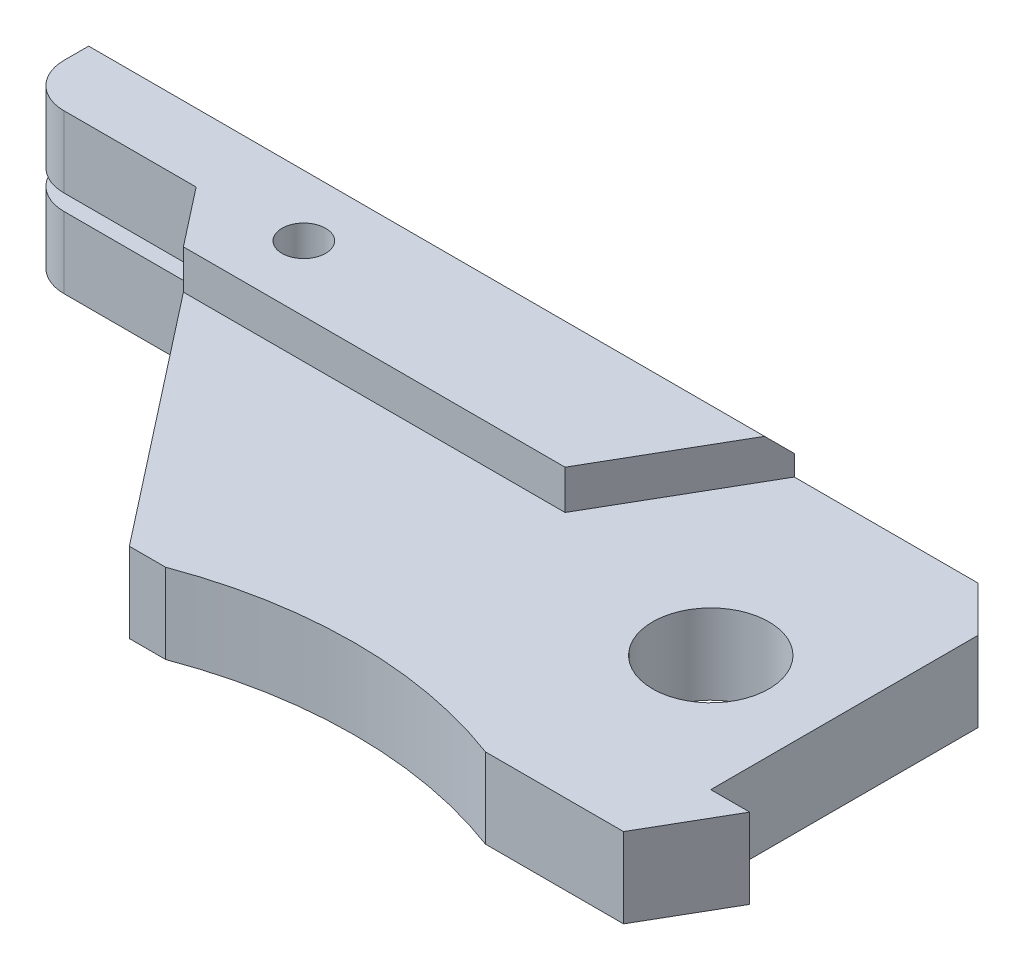
ISO-10303-21;
HEADER;
FILE_DESCRIPTION(('STEP AP214'),'2;1');
FILE_NAME('part.step','',(''),(''),'','','');
FILE_SCHEMA(('AUTOMOTIVE_DESIGN { 1 0 10303 214 1 1 1 1 }'));
ENDSEC;
DATA;
#1=APPLICATION_CONTEXT('core data for automotive mechanical design processes');
#2=APPLICATION_PROTOCOL_DEFINITION('international standard','automotive_design',2000,#1);
#3=PRODUCT_CONTEXT('',#1,'mechanical');
#4=PRODUCT('Part','Part','',(#3));
#5=PRODUCT_RELATED_PRODUCT_CATEGORY('part','',(#4));
#6=PRODUCT_DEFINITION_FORMATION('','',#4);
#7=PRODUCT_DEFINITION_CONTEXT('part definition',#1,'design');
#8=PRODUCT_DEFINITION('design','',#6,#7);
#9=PRODUCT_DEFINITION_SHAPE('','',#8);
#10=(LENGTH_UNIT() NAMED_UNIT(*) SI_UNIT(.MILLI.,.METRE.));
#11=(NAMED_UNIT(*) PLANE_ANGLE_UNIT() SI_UNIT($,.RADIAN.));
#12=(NAMED_UNIT(*) SI_UNIT($,.STERADIAN.) SOLID_ANGLE_UNIT());
#13=UNCERTAINTY_MEASURE_WITH_UNIT(LENGTH_MEASURE(1.E-05),#10,'distance_accuracy_value','');
#14=(GEOMETRIC_REPRESENTATION_CONTEXT(3) GLOBAL_UNCERTAINTY_ASSIGNED_CONTEXT((#13)) GLOBAL_UNIT_ASSIGNED_CONTEXT((#10,
#11,#12)) REPRESENTATION_CONTEXT('',''));
#15=CARTESIAN_POINT('',(0.,0.,0.));
#16=DIRECTION('',(0.,0.,1.));
#17=DIRECTION('',(1.,0.,0.));
#18=AXIS2_PLACEMENT_3D('',#15,#16,#17);
#19=CARTESIAN_POINT('',(-13.,-2.75,42.75));
#20=DIRECTION('',(0.,-1.,0.));
#21=DIRECTION('',(0.,0.,1.));
#22=AXIS2_PLACEMENT_3D('',#19,#20,#21);
#23=PLANE('',#22);
#24=CARTESIAN_POINT('',(0.,-2.75,0.));
#25=DIRECTION('',(0.,1.,0.));
#26=DIRECTION('',(0.,0.,1.));
#27=AXIS2_PLACEMENT_3D('',#24,#25,#26);
#28=CIRCLE('',#27,4.);
#29=CARTESIAN_POINT('',(0.,-2.75,4.));
#30=VERTEX_POINT('',#29);
#31=EDGE_CURVE('E259',#30,#30,#28,.T.);
#32=ORIENTED_EDGE('',*,*,#31,.T.);
#33=EDGE_LOOP('',(#32));
#34=FACE_BOUND('',#33,.T.);
#35=DIRECTION('',(1.,0.,0.));
#36=VECTOR('',#35,1.);
#37=CARTESIAN_POINT('',(-39.7818556506143,-2.75,-3.49999999999999));
#38=LINE('',#37,#36);
#39=CARTESIAN_POINT('',(-39.7818556506143,-2.75,-3.49999999999999));
#40=VERTEX_POINT('',#39);
#41=CARTESIAN_POINT('',(-32.2181443493857,-2.75,-3.49999999999999));
#42=VERTEX_POINT('',#41);
#43=EDGE_CURVE('E277',#40,#42,#38,.T.);
#44=ORIENTED_EDGE('',*,*,#43,.T.);
#45=DIRECTION('',(-0.615661475325657,0.,0.788010753606723));
#46=VECTOR('',#45,1.);
#47=CARTESIAN_POINT('',(-32.2181443493857,-2.75,-3.49999999999999));
#48=LINE('',#47,#46);
#49=CARTESIAN_POINT('',(-28.3117162168521,-2.75,-8.5));
#50=VERTEX_POINT('',#49);
#51=EDGE_CURVE('E225',#50,#42,#48,.T.);
#52=ORIENTED_EDGE('',*,*,#51,.F.);
#53=DIRECTION('',(-1.,0.,0.));
#54=VECTOR('',#53,1.);
#55=CARTESIAN_POINT('',(-28.3117162168521,-2.75,-8.5));
#56=LINE('',#55,#54);
#57=CARTESIAN_POINT('',(-10.6367513459482,-2.75,-8.5));
#58=VERTEX_POINT('',#57);
#59=EDGE_CURVE('E875',#58,#50,#56,.T.);
#60=ORIENTED_EDGE('',*,*,#59,.F.);
#61=DIRECTION('',(0.500000000000004,0.,-0.866025403784436));
#62=VECTOR('',#61,1.);
#63=CARTESIAN_POINT('',(-13.5235026918963,-2.75,-3.5));
#64=LINE('',#63,#62);
#65=CARTESIAN_POINT('',(-7.75,-2.75,-13.5));
#66=VERTEX_POINT('',#65);
#67=EDGE_CURVE('E36',#58,#66,#64,.T.);
#68=ORIENTED_EDGE('',*,*,#67,.T.);
#69=DIRECTION('',(-1.,0.,0.));
#70=VECTOR('',#69,1.);
#71=CARTESIAN_POINT('',(4.88477631085025,-2.75,-13.5));
#72=LINE('',#71,#70);
#73=CARTESIAN_POINT('',(4.88477631085025,-2.75,-13.5));
#74=VERTEX_POINT('',#73);
#75=EDGE_CURVE('E273',#74,#66,#72,.T.);
#76=ORIENTED_EDGE('',*,*,#75,.F.);
#77=DIRECTION('',(-0.707106781186546,0.,-0.707106781186549));
#78=VECTOR('',#77,1.);
#79=CARTESIAN_POINT('',(8.,-2.75,-10.3847763108502));
#80=LINE('',#79,#78);
#81=CARTESIAN_POINT('',(8.,-2.75,-10.3847763108502));
#82=VERTEX_POINT('',#81);
#83=EDGE_CURVE('E276',#82,#74,#80,.T.);
#84=ORIENTED_EDGE('',*,*,#83,.F.);
#85=DIRECTION('',(0.,0.,-1.));
#86=VECTOR('',#85,1.);
#87=CARTESIAN_POINT('',(8.,-2.75,-10.3847763108502));
#88=LINE('',#87,#86);
#89=CARTESIAN_POINT('',(8.,-2.75,8.));
#90=VERTEX_POINT('',#89);
#91=EDGE_CURVE('E283',#90,#82,#88,.T.);
#92=ORIENTED_EDGE('',*,*,#91,.F.);
#93=DIRECTION('',(-1.,0.,0.));
#94=VECTOR('',#93,1.);
#95=CARTESIAN_POINT('',(8.,-2.75,8.));
#96=LINE('',#95,#94);
#97=CARTESIAN_POINT('',(10.6754264805429,-2.75,8.));
#98=VERTEX_POINT('',#97);
#99=EDGE_CURVE('E286',#98,#90,#96,.T.);
#100=ORIENTED_EDGE('',*,*,#99,.F.);
#101=DIRECTION('',(0.499999999999998,0.,-0.86602540378444));
#102=VECTOR('',#101,1.);
#103=CARTESIAN_POINT('',(10.6754264805429,-2.75,8.));
#104=LINE('',#103,#102);
#105=CARTESIAN_POINT('',(7.5,-2.75,13.5));
#106=VERTEX_POINT('',#105);
#107=EDGE_CURVE('E289',#106,#98,#104,.T.);
#108=ORIENTED_EDGE('',*,*,#107,.F.);
#109=DIRECTION('',(1.,0.,0.));
#110=VECTOR('',#109,1.);
#111=CARTESIAN_POINT('',(7.5,-2.75,13.5));
#112=LINE('',#111,#110);
#113=CARTESIAN_POINT('',(-2.,-2.75,13.5));
#114=VERTEX_POINT('',#113);
#115=EDGE_CURVE('E292',#114,#106,#112,.T.);
#116=ORIENTED_EDGE('',*,*,#115,.F.);
#117=CARTESIAN_POINT('',(-13.,-2.75,42.75));
#118=DIRECTION('',(0.,-1.,0.));
#119=DIRECTION('',(0.,0.,1.));
#120=AXIS2_PLACEMENT_3D('',#117,#118,#119);
#121=CIRCLE('',#120,31.25);
#122=CARTESIAN_POINT('',(-24.,-2.75,13.5));
#123=VERTEX_POINT('',#122);
#124=EDGE_CURVE('E294',#123,#114,#121,.T.);
#125=ORIENTED_EDGE('',*,*,#124,.F.);
#126=DIRECTION('',(1.,0.,0.));
#127=VECTOR('',#126,1.);
#128=CARTESIAN_POINT('',(-24.,-2.75,13.5));
#129=LINE('',#128,#127);
#130=CARTESIAN_POINT('',(-26.5,-2.75,13.5));
#131=VERTEX_POINT('',#130);
#132=EDGE_CURVE('E265',#131,#123,#129,.T.);
#133=ORIENTED_EDGE('',*,*,#132,.F.);
#134=DIRECTION('',(0.615661475325663,0.,0.788010753606719));
#135=VECTOR('',#134,1.);
#136=CARTESIAN_POINT('',(-42.9069981566412,-2.75,-7.49999999999999));
#137=LINE('',#136,#135);
#138=EDGE_CURVE('E262',#40,#131,#137,.T.);
#139=ORIENTED_EDGE('',*,*,#138,.F.);
#140=EDGE_LOOP('',(#44,#52,#60,#68,#76,#84,#92,#100,#108,#116,#125,#133,#139));
#141=FACE_BOUND('',#140,.T.);
#142=CARTESIAN_POINT('',(-9.99390827019096,-2.75,-0.34899496702501));
#143=DIRECTION('',(0.,-1.,0.));
#144=DIRECTION('',(0.,0.,-1.));
#145=AXIS2_PLACEMENT_3D('',#142,#143,#144);
#146=CIRCLE('',#145,2.);
#147=CARTESIAN_POINT('',(-9.99390827019096,-2.75,-2.34899496702501));
#148=VERTEX_POINT('',#147);
#149=EDGE_CURVE('E239',#148,#148,#146,.T.);
#150=ORIENTED_EDGE('',*,*,#149,.F.);
#151=EDGE_LOOP('',(#150));
#152=FACE_BOUND('',#151,.T.);
#153=ADVANCED_FACE('F32',(#34,#141,#152),#23,.T.);
#154=CARTESIAN_POINT('',(-13.,2.75,42.75));
#155=DIRECTION('',(0.,1.,0.));
#156=DIRECTION('',(0.,0.,1.));
#157=AXIS2_PLACEMENT_3D('',#154,#155,#156);
#158=PLANE('',#157);
#159=DIRECTION('',(0.500000000000004,0.,-0.866025403784436));
#160=VECTOR('',#159,1.);
#161=CARTESIAN_POINT('',(-13.5235026918963,2.75,-3.5));
#162=LINE('',#161,#160);
#163=CARTESIAN_POINT('',(-13.5235026918963,2.75,-3.5));
#164=VERTEX_POINT('',#163);
#165=CARTESIAN_POINT('',(-7.75,2.75,-13.5));
#166=VERTEX_POINT('',#165);
#167=EDGE_CURVE('E820',#164,#166,#162,.T.);
#168=ORIENTED_EDGE('',*,*,#167,.F.);
#169=DIRECTION('',(1.,0.,0.));
#170=VECTOR('',#169,1.);
#171=CARTESIAN_POINT('',(-39.7818556506143,2.75,-3.49999999999999));
#172=LINE('',#171,#170);
#173=CARTESIAN_POINT('',(-39.7818556506143,2.75,-3.49999999999999));
#174=VERTEX_POINT('',#173);
#175=EDGE_CURVE('E847',#174,#164,#172,.T.);
#176=ORIENTED_EDGE('',*,*,#175,.F.);
#177=DIRECTION('',(0.615661475325663,0.,0.788010753606719));
#178=VECTOR('',#177,1.);
#179=CARTESIAN_POINT('',(-42.9069981566412,2.75,-7.49999999999999));
#180=LINE('',#179,#178);
#181=CARTESIAN_POINT('',(-26.5,2.75,13.5));
#182=VERTEX_POINT('',#181);
#183=EDGE_CURVE('E334',#174,#182,#180,.T.);
#184=ORIENTED_EDGE('',*,*,#183,.T.);
#185=DIRECTION('',(1.,0.,0.));
#186=VECTOR('',#185,1.);
#187=CARTESIAN_POINT('',(-24.,2.75,13.5));
#188=LINE('',#187,#186);
#189=CARTESIAN_POINT('',(-24.,2.75,13.5));
#190=VERTEX_POINT('',#189);
#191=EDGE_CURVE('E337',#182,#190,#188,.T.);
#192=ORIENTED_EDGE('',*,*,#191,.T.);
#193=CARTESIAN_POINT('',(-13.,2.75,42.75));
#194=DIRECTION('',(0.,-1.,0.));
#195=DIRECTION('',(0.,0.,1.));
#196=AXIS2_PLACEMENT_3D('',#193,#194,#195);
#197=CIRCLE('',#196,31.25);
#198=CARTESIAN_POINT('',(-2.,2.75,13.5));
#199=VERTEX_POINT('',#198);
#200=EDGE_CURVE('E347',#190,#199,#197,.T.);
#201=ORIENTED_EDGE('',*,*,#200,.T.);
#202=DIRECTION('',(1.,0.,0.));
#203=VECTOR('',#202,1.);
#204=CARTESIAN_POINT('',(7.5,2.75,13.5));
#205=LINE('',#204,#203);
#206=CARTESIAN_POINT('',(7.5,2.75,13.5));
#207=VERTEX_POINT('',#206);
#208=EDGE_CURVE('E322',#199,#207,#205,.T.);
#209=ORIENTED_EDGE('',*,*,#208,.T.);
#210=DIRECTION('',(0.499999999999998,0.,-0.86602540378444));
#211=VECTOR('',#210,1.);
#212=CARTESIAN_POINT('',(10.6754264805429,2.75,8.));
#213=LINE('',#212,#211);
#214=CARTESIAN_POINT('',(10.6754264805429,2.75,8.));
#215=VERTEX_POINT('',#214);
#216=EDGE_CURVE('E350',#207,#215,#213,.T.);
#217=ORIENTED_EDGE('',*,*,#216,.T.);
#218=DIRECTION('',(-1.,0.,0.));
#219=VECTOR('',#218,1.);
#220=CARTESIAN_POINT('',(8.,2.75,8.));
#221=LINE('',#220,#219);
#222=CARTESIAN_POINT('',(8.,2.75,8.));
#223=VERTEX_POINT('',#222);
#224=EDGE_CURVE('E352',#215,#223,#221,.T.);
#225=ORIENTED_EDGE('',*,*,#224,.T.);
#226=DIRECTION('',(0.,0.,-1.));
#227=VECTOR('',#226,1.);
#228=CARTESIAN_POINT('',(8.,2.75,-10.3847763108502));
#229=LINE('',#228,#227);
#230=CARTESIAN_POINT('',(8.,2.75,-10.3847763108502));
#231=VERTEX_POINT('',#230);
#232=EDGE_CURVE('E354',#223,#231,#229,.T.);
#233=ORIENTED_EDGE('',*,*,#232,.T.);
#234=DIRECTION('',(-0.707106781186546,0.,-0.707106781186549));
#235=VECTOR('',#234,1.);
#236=CARTESIAN_POINT('',(8.,2.75,-10.3847763108502));
#237=LINE('',#236,#235);
#238=CARTESIAN_POINT('',(4.88477631085025,2.75,-13.5));
#239=VERTEX_POINT('',#238);
#240=EDGE_CURVE('E356',#231,#239,#237,.T.);
#241=ORIENTED_EDGE('',*,*,#240,.T.);
#242=DIRECTION('',(-1.,0.,0.));
#243=VECTOR('',#242,1.);
#244=CARTESIAN_POINT('',(4.88477631085025,2.75,-13.5));
#245=LINE('',#244,#243);
#246=EDGE_CURVE('E339',#239,#166,#245,.T.);
#247=ORIENTED_EDGE('',*,*,#246,.T.);
#248=EDGE_LOOP('',(#168,#176,#184,#192,#201,#209,#217,#225,#233,#241,#247));
#249=FACE_BOUND('',#248,.T.);
#250=CARTESIAN_POINT('',(0.,2.75,0.));
#251=DIRECTION('',(0.,1.,0.));
#252=DIRECTION('',(0.,0.,1.));
#253=AXIS2_PLACEMENT_3D('',#250,#251,#252);
#254=CIRCLE('',#253,4.);
#255=CARTESIAN_POINT('',(0.,2.75,4.));
#256=VERTEX_POINT('',#255);
#257=EDGE_CURVE('E338',#256,#256,#254,.T.);
#258=ORIENTED_EDGE('',*,*,#257,.F.);
#259=EDGE_LOOP('',(#258));
#260=FACE_BOUND('',#259,.T.);
#261=ADVANCED_FACE('F382',(#249,#260),#158,.T.);
#262=CARTESIAN_POINT('',(-55.,2.75,-7.49999999999999));
#263=DIRECTION('',(1.,0.,0.));
#264=DIRECTION('',(0.,0.,-1.));
#265=AXIS2_PLACEMENT_3D('',#262,#263,#264);
#266=PLANE('',#265);
#267=DIRECTION('',(0.,0.,1.));
#268=VECTOR('',#267,1.);
#269=CARTESIAN_POINT('',(-55.,5.45,-13.5));
#270=LINE('',#269,#268);
#271=CARTESIAN_POINT('',(-55.,5.45,-12.2));
#272=VERTEX_POINT('',#271);
#273=CARTESIAN_POINT('',(-55.,5.45,-10.5));
#274=VERTEX_POINT('',#273);
#275=EDGE_CURVE('E795',#272,#274,#270,.T.);
#276=ORIENTED_EDGE('',*,*,#275,.F.);
#277=DIRECTION('',(0.,-0.70710678118655,-0.707106781186545));
#278=VECTOR('',#277,1.);
#279=CARTESIAN_POINT('',(-55.,5.45,-12.2));
#280=LINE('',#279,#278);
#281=CARTESIAN_POINT('',(-55.,4.15,-13.5));
#282=VERTEX_POINT('',#281);
#283=EDGE_CURVE('E813',#272,#282,#280,.T.);
#284=ORIENTED_EDGE('',*,*,#283,.T.);
#285=DIRECTION('',(0.,-1.,0.));
#286=VECTOR('',#285,1.);
#287=CARTESIAN_POINT('',(-55.,2.75,-13.5));
#288=LINE('',#287,#286);
#289=CARTESIAN_POINT('',(-55.,-4.15,-13.5));
#290=VERTEX_POINT('',#289);
#291=EDGE_CURVE('E359',#282,#290,#288,.T.);
#292=ORIENTED_EDGE('',*,*,#291,.T.);
#293=DIRECTION('',(0.,0.70710678118655,-0.707106781186545));
#294=VECTOR('',#293,1.);
#295=CARTESIAN_POINT('',(-55.,-5.45,-12.2));
#296=LINE('',#295,#294);
#297=CARTESIAN_POINT('',(-55.,-5.45,-12.2));
#298=VERTEX_POINT('',#297);
#299=EDGE_CURVE('E885',#298,#290,#296,.T.);
#300=ORIENTED_EDGE('',*,*,#299,.F.);
#301=DIRECTION('',(0.,0.,1.));
#302=VECTOR('',#301,1.);
#303=CARTESIAN_POINT('',(-55.,-5.45,-13.5));
#304=LINE('',#303,#302);
#305=CARTESIAN_POINT('',(-55.,-5.45,-10.5));
#306=VERTEX_POINT('',#305);
#307=EDGE_CURVE('E247',#298,#306,#304,.T.);
#308=ORIENTED_EDGE('',*,*,#307,.T.);
#309=DIRECTION('',(0.,1.,0.));
#310=VECTOR('',#309,1.);
#311=CARTESIAN_POINT('',(-55.,-2.75,-10.5));
#312=LINE('',#311,#310);
#313=CARTESIAN_POINT('',(-55.,-0.55,-10.5));
#314=VERTEX_POINT('',#313);
#315=EDGE_CURVE('E904',#314,#306,#312,.F.);
#316=ORIENTED_EDGE('',*,*,#315,.F.);
#317=DIRECTION('',(0.,-1.,0.));
#318=VECTOR('',#317,1.);
#319=CARTESIAN_POINT('',(-55.,0.55,-10.5));
#320=LINE('',#319,#318);
#321=CARTESIAN_POINT('',(-55.,0.55,-10.5));
#322=VERTEX_POINT('',#321);
#323=EDGE_CURVE('E831',#322,#314,#320,.T.);
#324=ORIENTED_EDGE('',*,*,#323,.F.);
#325=DIRECTION('',(0.,-1.,0.));
#326=VECTOR('',#325,1.);
#327=CARTESIAN_POINT('',(-55.,2.75,-10.5));
#328=LINE('',#327,#326);
#329=EDGE_CURVE('E802',#322,#274,#328,.F.);
#330=ORIENTED_EDGE('',*,*,#329,.T.);
#331=EDGE_LOOP('',(#276,#284,#292,#300,#308,#316,#324,#330));
#332=FACE_BOUND('',#331,.T.);
#333=ADVANCED_FACE('F402',(#332),#266,.F.);
#334=CARTESIAN_POINT('',(-42.9069981566412,2.75,-7.49999999999999));
#335=DIRECTION('',(0.,0.,-1.));
#336=DIRECTION('',(-1.,0.,0.));
#337=AXIS2_PLACEMENT_3D('',#334,#335,#336);
#338=PLANE('',#337);
#339=DIRECTION('',(1.,0.,0.));
#340=VECTOR('',#339,1.);
#341=CARTESIAN_POINT('',(-55.,5.45,-7.49999999999999));
#342=LINE('',#341,#340);
#343=CARTESIAN_POINT('',(-52.,5.45,-7.49999999999999));
#344=VERTEX_POINT('',#343);
#345=CARTESIAN_POINT('',(-42.9069981566412,5.45,-7.49999999999999));
#346=VERTEX_POINT('',#345);
#347=EDGE_CURVE('E788',#344,#346,#342,.T.);
#348=ORIENTED_EDGE('',*,*,#347,.F.);
#349=DIRECTION('',(0.,-1.,0.));
#350=VECTOR('',#349,1.);
#351=CARTESIAN_POINT('',(-52.,2.75,-7.49999999999999));
#352=LINE('',#351,#350);
#353=CARTESIAN_POINT('',(-52.,0.55,-7.49999999999999));
#354=VERTEX_POINT('',#353);
#355=EDGE_CURVE('E790',#344,#354,#352,.T.);
#356=ORIENTED_EDGE('',*,*,#355,.T.);
#357=DIRECTION('',(1.,0.,0.));
#358=VECTOR('',#357,1.);
#359=CARTESIAN_POINT('',(-42.9069981566412,0.55,-7.49999999999999));
#360=LINE('',#359,#358);
#361=CARTESIAN_POINT('',(-42.9069981566412,0.55,-7.49999999999999));
#362=VERTEX_POINT('',#361);
#363=EDGE_CURVE('E829',#354,#362,#360,.T.);
#364=ORIENTED_EDGE('',*,*,#363,.T.);
#365=DIRECTION('',(0.,-1.,0.));
#366=VECTOR('',#365,1.);
#367=CARTESIAN_POINT('',(-42.9069981566412,2.75,-7.49999999999999));
#368=LINE('',#367,#366);
#369=EDGE_CURVE('E330',#346,#362,#368,.T.);
#370=ORIENTED_EDGE('',*,*,#369,.F.);
#371=EDGE_LOOP('',(#348,#356,#364,#370));
#372=FACE_BOUND('',#371,.T.);
#373=ADVANCED_FACE('F728',(#372),#338,.F.);
#374=CARTESIAN_POINT('',(-42.9069981566412,2.75,-7.49999999999999));
#375=DIRECTION('',(0.788010753606719,0.,-0.615661475325663));
#376=DIRECTION('',(-0.615661475325663,0.,-0.788010753606719));
#377=AXIS2_PLACEMENT_3D('',#374,#375,#376);
#378=PLANE('',#377);
#379=DIRECTION('',(0.615661475325663,0.,0.788010753606719));
#380=VECTOR('',#379,1.);
#381=CARTESIAN_POINT('',(-42.9069981566412,0.55,-7.49999999999999));
#382=LINE('',#381,#380);
#383=CARTESIAN_POINT('',(-29.6251425060269,0.55,9.5));
#384=VERTEX_POINT('',#383);
#385=EDGE_CURVE('E825',#362,#384,#382,.T.);
#386=ORIENTED_EDGE('',*,*,#385,.T.);
#387=DIRECTION('',(0.,-1.,0.));
#388=VECTOR('',#387,1.);
#389=CARTESIAN_POINT('',(-29.6251425060269,2.75,9.5));
#390=LINE('',#389,#388);
#391=CARTESIAN_POINT('',(-29.6251425060269,-0.55,9.5));
#392=VERTEX_POINT('',#391);
#393=EDGE_CURVE('E333',#384,#392,#390,.T.);
#394=ORIENTED_EDGE('',*,*,#393,.T.);
#395=DIRECTION('',(0.615661475325663,0.,0.788010753606719));
#396=VECTOR('',#395,1.);
#397=CARTESIAN_POINT('',(-42.9069981566412,-0.55,-7.49999999999999));
#398=LINE('',#397,#396);
#399=CARTESIAN_POINT('',(-42.9069981566412,-0.55,-7.49999999999999));
#400=VERTEX_POINT('',#399);
#401=EDGE_CURVE('E896',#400,#392,#398,.T.);
#402=ORIENTED_EDGE('',*,*,#401,.F.);
#403=DIRECTION('',(0.,1.,0.));
#404=VECTOR('',#403,1.);
#405=CARTESIAN_POINT('',(-42.9069981566412,-2.75,-7.49999999999999));
#406=LINE('',#405,#404);
#407=CARTESIAN_POINT('',(-42.9069981566412,-5.45,-7.49999999999999));
#408=VERTEX_POINT('',#407);
#409=EDGE_CURVE('E271',#408,#400,#406,.T.);
#410=ORIENTED_EDGE('',*,*,#409,.F.);
#411=DIRECTION('',(0.615661475325663,0.,0.788010753606719));
#412=VECTOR('',#411,1.);
#413=CARTESIAN_POINT('',(-42.9069981566412,-5.45,-7.49999999999999));
#414=LINE('',#413,#412);
#415=CARTESIAN_POINT('',(-39.7818556506143,-5.45,-3.49999999999999));
#416=VERTEX_POINT('',#415);
#417=EDGE_CURVE('E245',#408,#416,#414,.T.);
#418=ORIENTED_EDGE('',*,*,#417,.T.);
#419=DIRECTION('',(0.,1.,0.));
#420=VECTOR('',#419,1.);
#421=CARTESIAN_POINT('',(-39.7818556506143,-5.45,-3.49999999999999));
#422=LINE('',#421,#420);
#423=EDGE_CURVE('E242',#416,#40,#422,.T.);
#424=ORIENTED_EDGE('',*,*,#423,.T.);
#425=ORIENTED_EDGE('',*,*,#138,.T.);
#426=DIRECTION('',(0.,-1.,0.));
#427=VECTOR('',#426,1.);
#428=CARTESIAN_POINT('',(-26.5,2.75,13.5));
#429=LINE('',#428,#427);
#430=EDGE_CURVE('E309',#182,#131,#429,.T.);
#431=ORIENTED_EDGE('',*,*,#430,.F.);
#432=ORIENTED_EDGE('',*,*,#183,.F.);
#433=DIRECTION('',(0.,-1.,0.));
#434=VECTOR('',#433,1.);
#435=CARTESIAN_POINT('',(-39.7818556506143,5.45,-3.49999999999999));
#436=LINE('',#435,#434);
#437=CARTESIAN_POINT('',(-39.7818556506143,5.45,-3.49999999999999));
#438=VERTEX_POINT('',#437);
#439=EDGE_CURVE('E857',#438,#174,#436,.T.);
#440=ORIENTED_EDGE('',*,*,#439,.F.);
#441=DIRECTION('',(0.615661475325663,0.,0.788010753606719));
#442=VECTOR('',#441,1.);
#443=CARTESIAN_POINT('',(-42.9069981566412,5.45,-7.49999999999999));
#444=LINE('',#443,#442);
#445=EDGE_CURVE('E848',#346,#438,#444,.T.);
#446=ORIENTED_EDGE('',*,*,#445,.F.);
#447=ORIENTED_EDGE('',*,*,#369,.T.);
#448=EDGE_LOOP('',(#386,#394,#402,#410,#418,#424,#425,#431,#432,#440,#446,#447));
#449=FACE_BOUND('',#448,.T.);
#450=ADVANCED_FACE('F394',(#449),#378,.F.);
#451=CARTESIAN_POINT('',(-24.,2.75,13.5));
#452=DIRECTION('',(0.,0.,-1.));
#453=DIRECTION('',(-1.,0.,0.));
#454=AXIS2_PLACEMENT_3D('',#451,#452,#453);
#455=PLANE('',#454);
#456=ORIENTED_EDGE('',*,*,#430,.T.);
#457=ORIENTED_EDGE('',*,*,#132,.T.);
#458=DIRECTION('',(0.,-1.,0.));
#459=VECTOR('',#458,1.);
#460=CARTESIAN_POINT('',(-24.,2.75,13.5));
#461=LINE('',#460,#459);
#462=EDGE_CURVE('E306',#190,#123,#461,.T.);
#463=ORIENTED_EDGE('',*,*,#462,.F.);
#464=ORIENTED_EDGE('',*,*,#191,.F.);
#465=EDGE_LOOP('',(#456,#457,#463,#464));
#466=FACE_BOUND('',#465,.T.);
#467=ADVANCED_FACE('F304',(#466),#455,.F.);
#468=CARTESIAN_POINT('',(-13.,2.75,42.75));
#469=DIRECTION('',(0.,-1.,0.));
#470=DIRECTION('',(0.,0.,-1.));
#471=AXIS2_PLACEMENT_3D('',#468,#469,#470);
#472=CYLINDRICAL_SURFACE('',#471,31.25);
#473=ORIENTED_EDGE('',*,*,#462,.T.);
#474=ORIENTED_EDGE('',*,*,#124,.T.);
#475=DIRECTION('',(0.,-1.,0.));
#476=VECTOR('',#475,1.);
#477=CARTESIAN_POINT('',(-2.,2.75,13.5));
#478=LINE('',#477,#476);
#479=EDGE_CURVE('E321',#199,#114,#478,.T.);
#480=ORIENTED_EDGE('',*,*,#479,.F.);
#481=ORIENTED_EDGE('',*,*,#200,.F.);
#482=EDGE_LOOP('',(#473,#474,#480,#481));
#483=FACE_BOUND('',#482,.T.);
#484=ADVANCED_FACE('F386',(#483),#472,.F.);
#485=CARTESIAN_POINT('',(7.5,2.75,13.5));
#486=DIRECTION('',(0.,0.,-1.));
#487=DIRECTION('',(-1.,0.,0.));
#488=AXIS2_PLACEMENT_3D('',#485,#486,#487);
#489=PLANE('',#488);
#490=ORIENTED_EDGE('',*,*,#479,.T.);
#491=ORIENTED_EDGE('',*,*,#115,.T.);
#492=DIRECTION('',(0.,-1.,0.));
#493=VECTOR('',#492,1.);
#494=CARTESIAN_POINT('',(7.5,2.75,13.5));
#495=LINE('',#494,#493);
#496=EDGE_CURVE('E319',#207,#106,#495,.T.);
#497=ORIENTED_EDGE('',*,*,#496,.F.);
#498=ORIENTED_EDGE('',*,*,#208,.F.);
#499=EDGE_LOOP('',(#490,#491,#497,#498));
#500=FACE_BOUND('',#499,.T.);
#501=ADVANCED_FACE('F317',(#500),#489,.F.);
#502=CARTESIAN_POINT('',(10.6754264805429,2.75,8.));
#503=DIRECTION('',(-0.86602540378444,0.,-0.499999999999998));
#504=DIRECTION('',(-0.499999999999998,0.,0.86602540378444));
#505=AXIS2_PLACEMENT_3D('',#502,#503,#504);
#506=PLANE('',#505);
#507=ORIENTED_EDGE('',*,*,#496,.T.);
#508=ORIENTED_EDGE('',*,*,#107,.T.);
#509=DIRECTION('',(0.,-1.,0.));
#510=VECTOR('',#509,1.);
#511=CARTESIAN_POINT('',(10.6754264805429,2.75,8.));
#512=LINE('',#511,#510);
#513=EDGE_CURVE('E325',#215,#98,#512,.T.);
#514=ORIENTED_EDGE('',*,*,#513,.F.);
#515=ORIENTED_EDGE('',*,*,#216,.F.);
#516=EDGE_LOOP('',(#507,#508,#514,#515));
#517=FACE_BOUND('',#516,.T.);
#518=ADVANCED_FACE('F373',(#517),#506,.F.);
#519=CARTESIAN_POINT('',(8.,2.75,8.));
#520=DIRECTION('',(0.,0.,1.));
#521=DIRECTION('',(1.,0.,0.));
#522=AXIS2_PLACEMENT_3D('',#519,#520,#521);
#523=PLANE('',#522);
#524=ORIENTED_EDGE('',*,*,#513,.T.);
#525=ORIENTED_EDGE('',*,*,#99,.T.);
#526=DIRECTION('',(0.,-1.,0.));
#527=VECTOR('',#526,1.);
#528=CARTESIAN_POINT('',(8.,2.75,8.));
#529=LINE('',#528,#527);
#530=EDGE_CURVE('E365',#223,#90,#529,.T.);
#531=ORIENTED_EDGE('',*,*,#530,.F.);
#532=ORIENTED_EDGE('',*,*,#224,.F.);
#533=EDGE_LOOP('',(#524,#525,#531,#532));
#534=FACE_BOUND('',#533,.T.);
#535=ADVANCED_FACE('F369',(#534),#523,.F.);
#536=CARTESIAN_POINT('',(8.,2.75,-10.3847763108502));
#537=DIRECTION('',(-1.,0.,0.));
#538=DIRECTION('',(0.,0.,1.));
#539=AXIS2_PLACEMENT_3D('',#536,#537,#538);
#540=PLANE('',#539);
#541=ORIENTED_EDGE('',*,*,#530,.T.);
#542=ORIENTED_EDGE('',*,*,#91,.T.);
#543=DIRECTION('',(0.,-1.,0.));
#544=VECTOR('',#543,1.);
#545=CARTESIAN_POINT('',(8.,2.75,-10.3847763108502));
#546=LINE('',#545,#544);
#547=EDGE_CURVE('E363',#231,#82,#546,.T.);
#548=ORIENTED_EDGE('',*,*,#547,.F.);
#549=ORIENTED_EDGE('',*,*,#232,.F.);
#550=EDGE_LOOP('',(#541,#542,#548,#549));
#551=FACE_BOUND('',#550,.T.);
#552=ADVANCED_FACE('F378',(#551),#540,.F.);
#553=CARTESIAN_POINT('',(8.,2.75,-10.3847763108502));
#554=DIRECTION('',(-0.707106781186549,0.,0.707106781186546));
#555=DIRECTION('',(0.707106781186546,0.,0.707106781186549));
#556=AXIS2_PLACEMENT_3D('',#553,#554,#555);
#557=PLANE('',#556);
#558=ORIENTED_EDGE('',*,*,#547,.T.);
#559=ORIENTED_EDGE('',*,*,#83,.T.);
#560=DIRECTION('',(0.,-1.,0.));
#561=VECTOR('',#560,1.);
#562=CARTESIAN_POINT('',(4.88477631085025,2.75,-13.5));
#563=LINE('',#562,#561);
#564=EDGE_CURVE('E361',#239,#74,#563,.T.);
#565=ORIENTED_EDGE('',*,*,#564,.F.);
#566=ORIENTED_EDGE('',*,*,#240,.F.);
#567=EDGE_LOOP('',(#558,#559,#565,#566));
#568=FACE_BOUND('',#567,.T.);
#569=ADVANCED_FACE('F462',(#568),#557,.F.);
#570=CARTESIAN_POINT('',(4.88477631085025,2.75,-13.5));
#571=DIRECTION('',(0.,0.,1.));
#572=DIRECTION('',(1.,0.,0.));
#573=AXIS2_PLACEMENT_3D('',#570,#571,#572);
#574=PLANE('',#573);
#575=ORIENTED_EDGE('',*,*,#291,.F.);
#576=DIRECTION('',(1.,0.,0.));
#577=VECTOR('',#576,1.);
#578=CARTESIAN_POINT('',(-7.75,4.15,-13.5));
#579=LINE('',#578,#577);
#580=CARTESIAN_POINT('',(-7.75,4.15,-13.5));
#581=VERTEX_POINT('',#580);
#582=EDGE_CURVE('E42',#282,#581,#579,.T.);
#583=ORIENTED_EDGE('',*,*,#582,.T.);
#584=DIRECTION('',(0.,-1.,0.));
#585=VECTOR('',#584,1.);
#586=CARTESIAN_POINT('',(-7.75,5.45,-13.5));
#587=LINE('',#586,#585);
#588=EDGE_CURVE('E794',#581,#166,#587,.T.);
#589=ORIENTED_EDGE('',*,*,#588,.T.);
#590=ORIENTED_EDGE('',*,*,#246,.F.);
#591=ORIENTED_EDGE('',*,*,#564,.T.);
#592=ORIENTED_EDGE('',*,*,#75,.T.);
#593=DIRECTION('',(0.,1.,0.));
#594=VECTOR('',#593,1.);
#595=CARTESIAN_POINT('',(-7.75,-5.45,-13.5));
#596=LINE('',#595,#594);
#597=CARTESIAN_POINT('',(-7.75,-4.15,-13.5));
#598=VERTEX_POINT('',#597);
#599=EDGE_CURVE('E256',#598,#66,#596,.T.);
#600=ORIENTED_EDGE('',*,*,#599,.F.);
#601=DIRECTION('',(1.,0.,0.));
#602=VECTOR('',#601,1.);
#603=CARTESIAN_POINT('',(-7.75,-4.15,-13.5));
#604=LINE('',#603,#602);
#605=EDGE_CURVE('E887',#290,#598,#604,.T.);
#606=ORIENTED_EDGE('',*,*,#605,.F.);
#607=EDGE_LOOP('',(#575,#583,#589,#590,#591,#592,#600,#606));
#608=FACE_BOUND('',#607,.T.);
#609=ADVANCED_FACE('F457',(#608),#574,.F.);
#610=CARTESIAN_POINT('',(0.,2.75,0.));
#611=DIRECTION('',(0.,-1.,0.));
#612=DIRECTION('',(0.,0.,-1.));
#613=AXIS2_PLACEMENT_3D('',#610,#611,#612);
#614=CYLINDRICAL_SURFACE('',#613,4.);
#615=ORIENTED_EDGE('',*,*,#257,.T.);
#616=EDGE_LOOP('',(#615));
#617=FACE_BOUND('',#616,.T.);
#618=ORIENTED_EDGE('',*,*,#31,.F.);
#619=EDGE_LOOP('',(#618));
#620=FACE_BOUND('',#619,.T.);
#621=ADVANCED_FACE('F454',(#617,#620),#614,.F.);
#622=CARTESIAN_POINT('',(-36.,2.75,-8.));
#623=DIRECTION('',(0.,-1.,0.));
#624=DIRECTION('',(0.,0.,-1.));
#625=AXIS2_PLACEMENT_3D('',#622,#623,#624);
#626=CYLINDRICAL_SURFACE('',#625,1.5);
#627=CARTESIAN_POINT('',(-36.,0.55,-8.));
#628=DIRECTION('',(0.,1.,0.));
#629=DIRECTION('',(0.,0.,1.));
#630=AXIS2_PLACEMENT_3D('',#627,#628,#629);
#631=CIRCLE('',#630,1.5);
#632=CARTESIAN_POINT('',(-36.,0.55,-6.49999999999999));
#633=VERTEX_POINT('',#632);
#634=EDGE_CURVE('E823',#633,#633,#631,.T.);
#635=ORIENTED_EDGE('',*,*,#634,.F.);
#636=EDGE_LOOP('',(#635));
#637=FACE_BOUND('',#636,.T.);
#638=CARTESIAN_POINT('',(-36.,5.45,-8.));
#639=DIRECTION('',(0.,1.,0.));
#640=DIRECTION('',(0.,0.,1.));
#641=AXIS2_PLACEMENT_3D('',#638,#639,#640);
#642=CIRCLE('',#641,1.5);
#643=CARTESIAN_POINT('',(-36.,5.45,-6.49999999999999));
#644=VERTEX_POINT('',#643);
#645=EDGE_CURVE('E844',#644,#644,#642,.T.);
#646=ORIENTED_EDGE('',*,*,#645,.T.);
#647=EDGE_LOOP('',(#646));
#648=FACE_BOUND('',#647,.T.);
#649=ADVANCED_FACE('F444',(#637,#648),#626,.F.);
#650=CARTESIAN_POINT('',(0.,5.45,0.));
#651=DIRECTION('',(0.,1.,0.));
#652=DIRECTION('',(0.,0.,1.));
#653=AXIS2_PLACEMENT_3D('',#650,#651,#652);
#654=PLANE('',#653);
#655=DIRECTION('',(0.500000000000004,0.,-0.866025403784436));
#656=VECTOR('',#655,1.);
#657=CARTESIAN_POINT('',(-13.5235026918963,5.45,-3.5));
#658=LINE('',#657,#656);
#659=CARTESIAN_POINT('',(-13.5235026918963,5.45,-3.5));
#660=VERTEX_POINT('',#659);
#661=CARTESIAN_POINT('',(-8.50055534994652,5.45,-12.2));
#662=VERTEX_POINT('',#661);
#663=EDGE_CURVE('E852',#660,#662,#658,.T.);
#664=ORIENTED_EDGE('',*,*,#663,.T.);
#665=DIRECTION('',(-1.,0.,0.));
#666=VECTOR('',#665,1.);
#667=CARTESIAN_POINT('',(-55.,5.45,-12.2));
#668=LINE('',#667,#666);
#669=EDGE_CURVE('E810',#662,#272,#668,.T.);
#670=ORIENTED_EDGE('',*,*,#669,.T.);
#671=ORIENTED_EDGE('',*,*,#275,.T.);
#672=CARTESIAN_POINT('',(-52.,5.45,-10.5));
#673=DIRECTION('',(0.,1.,0.));
#674=DIRECTION('',(0.,0.,1.));
#675=AXIS2_PLACEMENT_3D('',#672,#673,#674);
#676=CIRCLE('',#675,3.);
#677=EDGE_CURVE('E799',#274,#344,#676,.T.);
#678=ORIENTED_EDGE('',*,*,#677,.T.);
#679=ORIENTED_EDGE('',*,*,#347,.T.);
#680=ORIENTED_EDGE('',*,*,#445,.T.);
#681=DIRECTION('',(1.,0.,0.));
#682=VECTOR('',#681,1.);
#683=CARTESIAN_POINT('',(-39.7818556506143,5.45,-3.49999999999999));
#684=LINE('',#683,#682);
#685=EDGE_CURVE('E850',#438,#660,#684,.T.);
#686=ORIENTED_EDGE('',*,*,#685,.T.);
#687=EDGE_LOOP('',(#664,#670,#671,#678,#679,#680,#686));
#688=FACE_BOUND('',#687,.T.);
#689=ORIENTED_EDGE('',*,*,#645,.F.);
#690=EDGE_LOOP('',(#689));
#691=FACE_BOUND('',#690,.T.);
#692=ADVANCED_FACE('F440',(#688,#691),#654,.T.);
#693=CARTESIAN_POINT('',(-39.7818556506143,5.45,-3.49999999999999));
#694=DIRECTION('',(0.,0.,-1.));
#695=DIRECTION('',(-1.,0.,0.));
#696=AXIS2_PLACEMENT_3D('',#693,#694,#695);
#697=PLANE('',#696);
#698=ORIENTED_EDGE('',*,*,#175,.T.);
#699=DIRECTION('',(0.,-1.,0.));
#700=VECTOR('',#699,1.);
#701=CARTESIAN_POINT('',(-13.5235026918963,5.45,-3.5));
#702=LINE('',#701,#700);
#703=EDGE_CURVE('E817',#660,#164,#702,.T.);
#704=ORIENTED_EDGE('',*,*,#703,.F.);
#705=ORIENTED_EDGE('',*,*,#685,.F.);
#706=ORIENTED_EDGE('',*,*,#439,.T.);
#707=EDGE_LOOP('',(#698,#704,#705,#706));
#708=FACE_BOUND('',#707,.T.);
#709=ADVANCED_FACE('F443',(#708),#697,.F.);
#710=CARTESIAN_POINT('',(-13.5235026918963,5.45,-3.5));
#711=DIRECTION('',(-0.866025403784436,0.,-0.500000000000004));
#712=DIRECTION('',(-0.500000000000004,0.,0.866025403784436));
#713=AXIS2_PLACEMENT_3D('',#710,#711,#712);
#714=PLANE('',#713);
#715=ORIENTED_EDGE('',*,*,#588,.F.);
#716=DIRECTION('',(-0.37796447300923,0.654653670707978,0.654653670707975));
#717=VECTOR('',#716,1.);
#718=CARTESIAN_POINT('',(-7.28619029995415,3.3466580344773,-14.3033419655227));
#719=LINE('',#718,#717);
#720=EDGE_CURVE('E11',#581,#662,#719,.T.);
#721=ORIENTED_EDGE('',*,*,#720,.T.);
#722=ORIENTED_EDGE('',*,*,#663,.F.);
#723=ORIENTED_EDGE('',*,*,#703,.T.);
#724=ORIENTED_EDGE('',*,*,#167,.T.);
#725=EDGE_LOOP('',(#715,#721,#722,#723,#724));
#726=FACE_BOUND('',#725,.T.);
#727=ADVANCED_FACE('F435',(#726),#714,.F.);
#728=CARTESIAN_POINT('',(-55.,0.55,9.5));
#729=DIRECTION('',(0.,0.,1.));
#730=DIRECTION('',(1.,0.,0.));
#731=AXIS2_PLACEMENT_3D('',#728,#729,#730);
#732=PLANE('',#731);
#733=DIRECTION('',(-1.,0.,0.));
#734=VECTOR('',#733,1.);
#735=CARTESIAN_POINT('',(-55.,0.55,9.5));
#736=LINE('',#735,#734);
#737=CARTESIAN_POINT('',(-7.37428746986548,0.55,9.5));
#738=VERTEX_POINT('',#737);
#739=EDGE_CURVE('E914',#738,#384,#736,.T.);
#740=ORIENTED_EDGE('',*,*,#739,.F.);
#741=DIRECTION('',(0.,-1.,0.));
#742=VECTOR('',#741,1.);
#743=CARTESIAN_POINT('',(-7.37428746986548,0.55,9.5));
#744=LINE('',#743,#742);
#745=CARTESIAN_POINT('',(-7.37428746986548,-0.55,9.5));
#746=VERTEX_POINT('',#745);
#747=EDGE_CURVE('E836',#738,#746,#744,.T.);
#748=ORIENTED_EDGE('',*,*,#747,.T.);
#749=DIRECTION('',(-1.,0.,0.));
#750=VECTOR('',#749,1.);
#751=CARTESIAN_POINT('',(-55.,-0.55,9.5));
#752=LINE('',#751,#750);
#753=EDGE_CURVE('E934',#746,#392,#752,.T.);
#754=ORIENTED_EDGE('',*,*,#753,.T.);
#755=ORIENTED_EDGE('',*,*,#393,.F.);
#756=EDGE_LOOP('',(#740,#748,#754,#755));
#757=FACE_BOUND('',#756,.T.);
#758=ADVANCED_FACE('F426',(#757),#732,.F.);
#759=CARTESIAN_POINT('',(0.,0.55,0.));
#760=DIRECTION('',(0.,1.,0.));
#761=DIRECTION('',(0.,0.,1.));
#762=AXIS2_PLACEMENT_3D('',#759,#760,#761);
#763=PLANE('',#762);
#764=ORIENTED_EDGE('',*,*,#634,.T.);
#765=EDGE_LOOP('',(#764));
#766=FACE_BOUND('',#765,.T.);
#767=ORIENTED_EDGE('',*,*,#363,.F.);
#768=CARTESIAN_POINT('',(-52.,0.55,-10.5));
#769=DIRECTION('',(0.,1.,0.));
#770=DIRECTION('',(0.,0.,1.));
#771=AXIS2_PLACEMENT_3D('',#768,#769,#770);
#772=CIRCLE('',#771,3.);
#773=EDGE_CURVE('E800',#354,#322,#772,.F.);
#774=ORIENTED_EDGE('',*,*,#773,.T.);
#775=DIRECTION('',(1.,0.,0.));
#776=VECTOR('',#775,1.);
#777=CARTESIAN_POINT('',(-23.,0.55,-10.5));
#778=LINE('',#777,#776);
#779=CARTESIAN_POINT('',(-23.,0.55,-10.5));
#780=VERTEX_POINT('',#779);
#781=EDGE_CURVE('E839',#322,#780,#778,.T.);
#782=ORIENTED_EDGE('',*,*,#781,.T.);
#783=DIRECTION('',(0.615661475325663,0.,0.788010753606719));
#784=VECTOR('',#783,1.);
#785=CARTESIAN_POINT('',(-7.37428746986548,0.55,9.5));
#786=LINE('',#785,#784);
#787=EDGE_CURVE('E912',#780,#738,#786,.T.);
#788=ORIENTED_EDGE('',*,*,#787,.T.);
#789=ORIENTED_EDGE('',*,*,#739,.T.);
#790=ORIENTED_EDGE('',*,*,#385,.F.);
#791=EDGE_LOOP('',(#767,#774,#782,#788,#789,#790));
#792=FACE_BOUND('',#791,.T.);
#793=ADVANCED_FACE('F422',(#766,#792),#763,.F.);
#794=CARTESIAN_POINT('',(-7.37428746986548,0.55,9.5));
#795=DIRECTION('',(0.788010753606719,0.,-0.615661475325663));
#796=DIRECTION('',(-0.615661475325663,0.,-0.788010753606719));
#797=AXIS2_PLACEMENT_3D('',#794,#795,#796);
#798=PLANE('',#797);
#799=DIRECTION('',(0.,-1.,0.));
#800=VECTOR('',#799,1.);
#801=CARTESIAN_POINT('',(-23.,0.55,-10.5));
#802=LINE('',#801,#800);
#803=CARTESIAN_POINT('',(-23.,-0.55,-10.5));
#804=VERTEX_POINT('',#803);
#805=EDGE_CURVE('E826',#780,#804,#802,.T.);
#806=ORIENTED_EDGE('',*,*,#805,.T.);
#807=DIRECTION('',(0.615661475325663,0.,0.788010753606719));
#808=VECTOR('',#807,1.);
#809=CARTESIAN_POINT('',(-7.37428746986548,-0.55,9.5));
#810=LINE('',#809,#808);
#811=EDGE_CURVE('E933',#804,#746,#810,.T.);
#812=ORIENTED_EDGE('',*,*,#811,.T.);
#813=ORIENTED_EDGE('',*,*,#747,.F.);
#814=ORIENTED_EDGE('',*,*,#787,.F.);
#815=EDGE_LOOP('',(#806,#812,#813,#814));
#816=FACE_BOUND('',#815,.T.);
#817=ADVANCED_FACE('F425',(#816),#798,.F.);
#818=CARTESIAN_POINT('',(-23.,0.55,-10.5));
#819=DIRECTION('',(0.,0.,-1.));
#820=DIRECTION('',(-1.,0.,0.));
#821=AXIS2_PLACEMENT_3D('',#818,#819,#820);
#822=PLANE('',#821);
#823=ORIENTED_EDGE('',*,*,#323,.T.);
#824=DIRECTION('',(1.,0.,0.));
#825=VECTOR('',#824,1.);
#826=CARTESIAN_POINT('',(-23.,-0.55,-10.5));
#827=LINE('',#826,#825);
#828=EDGE_CURVE('E897',#314,#804,#827,.T.);
#829=ORIENTED_EDGE('',*,*,#828,.T.);
#830=ORIENTED_EDGE('',*,*,#805,.F.);
#831=ORIENTED_EDGE('',*,*,#781,.F.);
#832=EDGE_LOOP('',(#823,#829,#830,#831));
#833=FACE_BOUND('',#832,.T.);
#834=ADVANCED_FACE('F428',(#833),#822,.F.);
#835=CARTESIAN_POINT('',(-52.,2.75,-10.5));
#836=DIRECTION('',(0.,-1.,0.));
#837=DIRECTION('',(0.,0.,-1.));
#838=AXIS2_PLACEMENT_3D('',#835,#836,#837);
#839=CYLINDRICAL_SURFACE('',#838,3.);
#840=ORIENTED_EDGE('',*,*,#677,.F.);
#841=ORIENTED_EDGE('',*,*,#329,.F.);
#842=ORIENTED_EDGE('',*,*,#773,.F.);
#843=ORIENTED_EDGE('',*,*,#355,.F.);
#844=EDGE_LOOP('',(#840,#841,#842,#843));
#845=FACE_BOUND('',#844,.T.);
#846=ADVANCED_FACE('F431',(#845),#839,.T.);
#847=CARTESIAN_POINT('',(0.,5.45,-12.2));
#848=DIRECTION('',(0.,0.707106781186545,-0.70710678118655));
#849=DIRECTION('',(1.,0.,0.));
#850=AXIS2_PLACEMENT_3D('',#847,#848,#849);
#851=PLANE('',#850);
#852=ORIENTED_EDGE('',*,*,#720,.F.);
#853=ORIENTED_EDGE('',*,*,#582,.F.);
#854=ORIENTED_EDGE('',*,*,#283,.F.);
#855=ORIENTED_EDGE('',*,*,#669,.F.);
#856=EDGE_LOOP('',(#852,#853,#854,#855));
#857=FACE_BOUND('',#856,.T.);
#858=ADVANCED_FACE('F34',(#857),#851,.T.);
#859=CARTESIAN_POINT('',(-42.9069981566412,-2.75,-7.49999999999999));
#860=DIRECTION('',(0.,0.,-1.));
#861=DIRECTION('',(-1.,0.,0.));
#862=AXIS2_PLACEMENT_3D('',#859,#860,#861);
#863=PLANE('',#862);
#864=DIRECTION('',(1.,0.,0.));
#865=VECTOR('',#864,1.);
#866=CARTESIAN_POINT('',(-55.,-5.45,-7.49999999999999));
#867=LINE('',#866,#865);
#868=CARTESIAN_POINT('',(-52.,-5.45,-7.49999999999999));
#869=VERTEX_POINT('',#868);
#870=EDGE_CURVE('E254',#869,#408,#867,.T.);
#871=ORIENTED_EDGE('',*,*,#870,.T.);
#872=ORIENTED_EDGE('',*,*,#409,.T.);
#873=DIRECTION('',(1.,0.,0.));
#874=VECTOR('',#873,1.);
#875=CARTESIAN_POINT('',(-42.9069981566412,-0.55,-7.49999999999999));
#876=LINE('',#875,#874);
#877=CARTESIAN_POINT('',(-52.,-0.55,-7.49999999999999));
#878=VERTEX_POINT('',#877);
#879=EDGE_CURVE('E942',#878,#400,#876,.T.);
#880=ORIENTED_EDGE('',*,*,#879,.F.);
#881=DIRECTION('',(0.,1.,0.));
#882=VECTOR('',#881,1.);
#883=CARTESIAN_POINT('',(-52.,-2.75,-7.49999999999999));
#884=LINE('',#883,#882);
#885=EDGE_CURVE('E898',#869,#878,#884,.T.);
#886=ORIENTED_EDGE('',*,*,#885,.F.);
#887=EDGE_LOOP('',(#871,#872,#880,#886));
#888=FACE_BOUND('',#887,.T.);
#889=ADVANCED_FACE('F408',(#888),#863,.F.);
#890=CARTESIAN_POINT('',(-36.,-2.75,-8.));
#891=DIRECTION('',(0.,1.,0.));
#892=DIRECTION('',(0.,0.,-1.));
#893=AXIS2_PLACEMENT_3D('',#890,#891,#892);
#894=CYLINDRICAL_SURFACE('',#893,1.5);
#895=CARTESIAN_POINT('',(-36.,-0.55,-8.));
#896=DIRECTION('',(0.,1.,0.));
#897=DIRECTION('',(0.,0.,1.));
#898=AXIS2_PLACEMENT_3D('',#895,#896,#897);
#899=CIRCLE('',#898,1.5);
#900=CARTESIAN_POINT('',(-36.,-0.55,-6.49999999999999));
#901=VERTEX_POINT('',#900);
#902=EDGE_CURVE('E893',#901,#901,#899,.T.);
#903=ORIENTED_EDGE('',*,*,#902,.T.);
#904=EDGE_LOOP('',(#903));
#905=FACE_BOUND('',#904,.T.);
#906=CARTESIAN_POINT('',(-36.,-5.45,-8.));
#907=DIRECTION('',(0.,1.,0.));
#908=DIRECTION('',(0.,0.,1.));
#909=AXIS2_PLACEMENT_3D('',#906,#907,#908);
#910=CIRCLE('',#909,1.5);
#911=CARTESIAN_POINT('',(-36.,-5.45,-6.49999999999999));
#912=VERTEX_POINT('',#911);
#913=EDGE_CURVE('E943',#912,#912,#910,.T.);
#914=ORIENTED_EDGE('',*,*,#913,.F.);
#915=EDGE_LOOP('',(#914));
#916=FACE_BOUND('',#915,.T.);
#917=ADVANCED_FACE('F406',(#905,#916),#894,.F.);
#918=CARTESIAN_POINT('',(0.,-5.45,0.));
#919=DIRECTION('',(0.,-1.,0.));
#920=DIRECTION('',(0.,0.,1.));
#921=AXIS2_PLACEMENT_3D('',#918,#919,#920);
#922=PLANE('',#921);
#923=DIRECTION('',(1.,0.,0.));
#924=VECTOR('',#923,1.);
#925=CARTESIAN_POINT('',(-28.3117162168521,-5.45,-8.5));
#926=LINE('',#925,#924);
#927=CARTESIAN_POINT('',(-28.3117162168521,-5.45,-8.5));
#928=VERTEX_POINT('',#927);
#929=CARTESIAN_POINT('',(-10.6367513459482,-5.45,-8.5));
#930=VERTEX_POINT('',#929);
#931=EDGE_CURVE('E231',#928,#930,#926,.T.);
#932=ORIENTED_EDGE('',*,*,#931,.F.);
#933=DIRECTION('',(0.615661475325657,0.,-0.788010753606723));
#934=VECTOR('',#933,1.);
#935=CARTESIAN_POINT('',(-32.2181443493857,-5.45,-3.49999999999999));
#936=LINE('',#935,#934);
#937=CARTESIAN_POINT('',(-32.2181443493857,-5.45,-3.49999999999999));
#938=VERTEX_POINT('',#937);
#939=EDGE_CURVE('E222',#938,#928,#936,.T.);
#940=ORIENTED_EDGE('',*,*,#939,.F.);
#941=DIRECTION('',(1.,0.,0.));
#942=VECTOR('',#941,1.);
#943=CARTESIAN_POINT('',(-39.7818556506143,-5.45,-3.49999999999999));
#944=LINE('',#943,#942);
#945=EDGE_CURVE('E236',#416,#938,#944,.T.);
#946=ORIENTED_EDGE('',*,*,#945,.F.);
#947=ORIENTED_EDGE('',*,*,#417,.F.);
#948=ORIENTED_EDGE('',*,*,#870,.F.);
#949=CARTESIAN_POINT('',(-52.,-5.45,-10.5));
#950=DIRECTION('',(0.,1.,0.));
#951=DIRECTION('',(0.,0.,1.));
#952=AXIS2_PLACEMENT_3D('',#949,#950,#951);
#953=CIRCLE('',#952,3.);
#954=EDGE_CURVE('E907',#306,#869,#953,.T.);
#955=ORIENTED_EDGE('',*,*,#954,.F.);
#956=ORIENTED_EDGE('',*,*,#307,.F.);
#957=DIRECTION('',(-1.,0.,0.));
#958=VECTOR('',#957,1.);
#959=CARTESIAN_POINT('',(-55.,-5.45,-12.2));
#960=LINE('',#959,#958);
#961=CARTESIAN_POINT('',(-8.50055534994652,-5.45,-12.2));
#962=VERTEX_POINT('',#961);
#963=EDGE_CURVE('E908',#962,#298,#960,.T.);
#964=ORIENTED_EDGE('',*,*,#963,.F.);
#965=DIRECTION('',(0.500000000000004,0.,-0.866025403784436));
#966=VECTOR('',#965,1.);
#967=CARTESIAN_POINT('',(-13.5235026918963,-5.45,-3.5));
#968=LINE('',#967,#966);
#969=EDGE_CURVE('E244',#930,#962,#968,.T.);
#970=ORIENTED_EDGE('',*,*,#969,.F.);
#971=EDGE_LOOP('',(#932,#940,#946,#947,#948,#955,#956,#964,#970));
#972=FACE_BOUND('',#971,.T.);
#973=ORIENTED_EDGE('',*,*,#913,.T.);
#974=EDGE_LOOP('',(#973));
#975=FACE_BOUND('',#974,.T.);
#976=ADVANCED_FACE('F234',(#972,#975),#922,.T.);
#977=CARTESIAN_POINT('',(-39.7818556506143,-5.45,-3.49999999999999));
#978=DIRECTION('',(0.,0.,-1.));
#979=DIRECTION('',(-1.,0.,0.));
#980=AXIS2_PLACEMENT_3D('',#977,#978,#979);
#981=PLANE('',#980);
#982=ORIENTED_EDGE('',*,*,#945,.T.);
#983=DIRECTION('',(0.,-1.,0.));
#984=VECTOR('',#983,1.);
#985=CARTESIAN_POINT('',(-32.2181443493857,19.4030251651737,-3.49999999999999));
#986=LINE('',#985,#984);
#987=EDGE_CURVE('E218',#42,#938,#986,.T.);
#988=ORIENTED_EDGE('',*,*,#987,.F.);
#989=ORIENTED_EDGE('',*,*,#43,.F.);
#990=ORIENTED_EDGE('',*,*,#423,.F.);
#991=EDGE_LOOP('',(#982,#988,#989,#990));
#992=FACE_BOUND('',#991,.T.);
#993=ADVANCED_FACE('F241',(#992),#981,.F.);
#994=CARTESIAN_POINT('',(-13.5235026918963,-5.45,-3.5));
#995=DIRECTION('',(-0.866025403784436,0.,-0.500000000000004));
#996=DIRECTION('',(-0.500000000000004,0.,0.866025403784436));
#997=AXIS2_PLACEMENT_3D('',#994,#995,#996);
#998=PLANE('',#997);
#999=ORIENTED_EDGE('',*,*,#67,.F.);
#1000=DIRECTION('',(0.,-1.,0.));
#1001=VECTOR('',#1000,1.);
#1002=CARTESIAN_POINT('',(-10.6367513459482,19.4030251651737,-8.5));
#1003=LINE('',#1002,#1001);
#1004=EDGE_CURVE('E49',#58,#930,#1003,.T.);
#1005=ORIENTED_EDGE('',*,*,#1004,.T.);
#1006=ORIENTED_EDGE('',*,*,#969,.T.);
#1007=DIRECTION('',(-0.37796447300923,-0.654653670707978,0.654653670707975));
#1008=VECTOR('',#1007,1.);
#1009=CARTESIAN_POINT('',(-7.28619029995415,-3.3466580344773,-14.3033419655227));
#1010=LINE('',#1009,#1008);
#1011=EDGE_CURVE('E877',#598,#962,#1010,.T.);
#1012=ORIENTED_EDGE('',*,*,#1011,.F.);
#1013=ORIENTED_EDGE('',*,*,#599,.T.);
#1014=EDGE_LOOP('',(#999,#1005,#1006,#1012,#1013));
#1015=FACE_BOUND('',#1014,.T.);
#1016=ADVANCED_FACE('F574',(#1015),#998,.F.);
#1017=CARTESIAN_POINT('',(0.,-0.55,0.));
#1018=DIRECTION('',(0.,-1.,0.));
#1019=DIRECTION('',(0.,0.,1.));
#1020=AXIS2_PLACEMENT_3D('',#1017,#1018,#1019);
#1021=PLANE('',#1020);
#1022=ORIENTED_EDGE('',*,*,#902,.F.);
#1023=EDGE_LOOP('',(#1022));
#1024=FACE_BOUND('',#1023,.T.);
#1025=ORIENTED_EDGE('',*,*,#879,.T.);
#1026=ORIENTED_EDGE('',*,*,#401,.T.);
#1027=ORIENTED_EDGE('',*,*,#753,.F.);
#1028=ORIENTED_EDGE('',*,*,#811,.F.);
#1029=ORIENTED_EDGE('',*,*,#828,.F.);
#1030=CARTESIAN_POINT('',(-52.,-0.55,-10.5));
#1031=DIRECTION('',(0.,1.,0.));
#1032=DIRECTION('',(0.,0.,1.));
#1033=AXIS2_PLACEMENT_3D('',#1030,#1031,#1032);
#1034=CIRCLE('',#1033,3.);
#1035=EDGE_CURVE('E901',#878,#314,#1034,.F.);
#1036=ORIENTED_EDGE('',*,*,#1035,.F.);
#1037=EDGE_LOOP('',(#1025,#1026,#1027,#1028,#1029,#1036));
#1038=FACE_BOUND('',#1037,.T.);
#1039=ADVANCED_FACE('F416',(#1024,#1038),#1021,.F.);
#1040=CARTESIAN_POINT('',(-52.,-2.75,-10.5));
#1041=DIRECTION('',(0.,1.,0.));
#1042=DIRECTION('',(0.,0.,-1.));
#1043=AXIS2_PLACEMENT_3D('',#1040,#1041,#1042);
#1044=CYLINDRICAL_SURFACE('',#1043,3.);
#1045=ORIENTED_EDGE('',*,*,#954,.T.);
#1046=ORIENTED_EDGE('',*,*,#885,.T.);
#1047=ORIENTED_EDGE('',*,*,#1035,.T.);
#1048=ORIENTED_EDGE('',*,*,#315,.T.);
#1049=EDGE_LOOP('',(#1045,#1046,#1047,#1048));
#1050=FACE_BOUND('',#1049,.T.);
#1051=ADVANCED_FACE('F412',(#1050),#1044,.T.);
#1052=CARTESIAN_POINT('',(0.,-5.45,-12.2));
#1053=DIRECTION('',(0.,-0.707106781186545,-0.70710678118655));
#1054=DIRECTION('',(1.,0.,0.));
#1055=AXIS2_PLACEMENT_3D('',#1052,#1053,#1054);
#1056=PLANE('',#1055);
#1057=ORIENTED_EDGE('',*,*,#1011,.T.);
#1058=ORIENTED_EDGE('',*,*,#963,.T.);
#1059=ORIENTED_EDGE('',*,*,#299,.T.);
#1060=ORIENTED_EDGE('',*,*,#605,.T.);
#1061=EDGE_LOOP('',(#1057,#1058,#1059,#1060));
#1062=FACE_BOUND('',#1061,.T.);
#1063=ADVANCED_FACE('F415',(#1062),#1056,.T.);
#1064=CARTESIAN_POINT('',(-28.3117162168521,19.4030251651737,-8.5));
#1065=DIRECTION('',(0.,0.,-1.));
#1066=DIRECTION('',(-1.,0.,0.));
#1067=AXIS2_PLACEMENT_3D('',#1064,#1065,#1066);
#1068=PLANE('',#1067);
#1069=ORIENTED_EDGE('',*,*,#59,.T.);
#1070=DIRECTION('',(0.,-1.,0.));
#1071=VECTOR('',#1070,1.);
#1072=CARTESIAN_POINT('',(-28.3117162168521,19.4030251651737,-8.5));
#1073=LINE('',#1072,#1071);
#1074=EDGE_CURVE('E230',#50,#928,#1073,.T.);
#1075=ORIENTED_EDGE('',*,*,#1074,.T.);
#1076=ORIENTED_EDGE('',*,*,#931,.T.);
#1077=ORIENTED_EDGE('',*,*,#1004,.F.);
#1078=EDGE_LOOP('',(#1069,#1075,#1076,#1077));
#1079=FACE_BOUND('',#1078,.T.);
#1080=ADVANCED_FACE('F420',(#1079),#1068,.F.);
#1081=CARTESIAN_POINT('',(-32.2181443493857,19.4030251651737,-3.49999999999999));
#1082=DIRECTION('',(-0.788010753606723,0.,-0.615661475325657));
#1083=DIRECTION('',(-0.615661475325657,0.,0.788010753606723));
#1084=AXIS2_PLACEMENT_3D('',#1081,#1082,#1083);
#1085=PLANE('',#1084);
#1086=ORIENTED_EDGE('',*,*,#51,.T.);
#1087=ORIENTED_EDGE('',*,*,#987,.T.);
#1088=ORIENTED_EDGE('',*,*,#939,.T.);
#1089=ORIENTED_EDGE('',*,*,#1074,.F.);
#1090=EDGE_LOOP('',(#1086,#1087,#1088,#1089));
#1091=FACE_BOUND('',#1090,.T.);
#1092=ADVANCED_FACE('F220',(#1091),#1085,.F.);
#1093=CARTESIAN_POINT('',(-9.99390827019096,-4.25,-0.34899496702501));
#1094=DIRECTION('',(0.,-1.,0.));
#1095=DIRECTION('',(-0.999390827019096,0.,-0.034899496702501));
#1096=AXIS2_PLACEMENT_3D('',#1093,#1094,#1095);
#1097=SPHERICAL_SURFACE('',#1096,2.5);
#1098=ORIENTED_EDGE('',*,*,#149,.T.);
#1099=EDGE_LOOP('',(#1098));
#1100=FACE_BOUND('',#1099,.T.);
#1101=ADVANCED_FACE('F606',(#1100),#1097,.F.);
#1102=CLOSED_SHELL('',(#153,#261,#333,#373,#450,#467,#484,#501,#518,#535,#552,#569,#609,#621,
#649,#692,#709,#727,#758,#793,#817,#834,#846,#858,#889,#917,#976,#993,#1016,#1039,#1051,#1063,
#1080,#1092,#1101));
#1103=MANIFOLD_SOLID_BREP('B2',#1102);
#1104=ADVANCED_BREP_SHAPE_REPRESENTATION('',(#18,#1103),#14);
#1105=SHAPE_DEFINITION_REPRESENTATION(#9,#1104);
ENDSEC;
END-ISO-10303-21;
